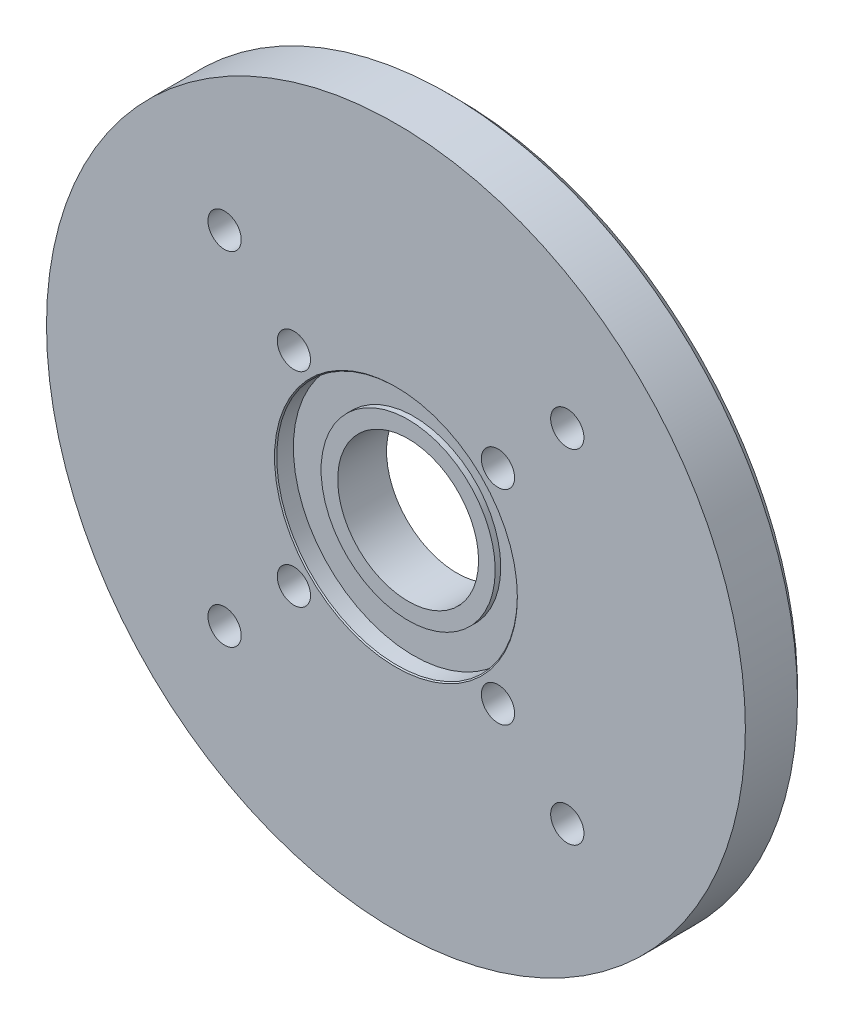
ISO-10303-21;
HEADER;
FILE_DESCRIPTION(('STEP AP214'),'2;1');
FILE_NAME('part.step','',(''),(''),'','','');
FILE_SCHEMA(('AUTOMOTIVE_DESIGN { 1 0 10303 214 1 1 1 1 }'));
ENDSEC;
DATA;
#1=APPLICATION_CONTEXT('core data for automotive mechanical design processes');
#2=APPLICATION_PROTOCOL_DEFINITION('international standard','automotive_design',2000,#1);
#3=PRODUCT_CONTEXT('',#1,'mechanical');
#4=PRODUCT('Part','Part','',(#3));
#5=PRODUCT_RELATED_PRODUCT_CATEGORY('part','',(#4));
#6=PRODUCT_DEFINITION_FORMATION('','',#4);
#7=PRODUCT_DEFINITION_CONTEXT('part definition',#1,'design');
#8=PRODUCT_DEFINITION('design','',#6,#7);
#9=PRODUCT_DEFINITION_SHAPE('','',#8);
#10=(LENGTH_UNIT() NAMED_UNIT(*) SI_UNIT(.MILLI.,.METRE.));
#11=(NAMED_UNIT(*) PLANE_ANGLE_UNIT() SI_UNIT($,.RADIAN.));
#12=(NAMED_UNIT(*) SI_UNIT($,.STERADIAN.) SOLID_ANGLE_UNIT());
#13=UNCERTAINTY_MEASURE_WITH_UNIT(LENGTH_MEASURE(1.E-05),#10,'distance_accuracy_value','');
#14=(GEOMETRIC_REPRESENTATION_CONTEXT(3) GLOBAL_UNCERTAINTY_ASSIGNED_CONTEXT((#13)) GLOBAL_UNIT_ASSIGNED_CONTEXT((#10,
#11,#12)) REPRESENTATION_CONTEXT('',''));
#15=CARTESIAN_POINT('',(0.,0.,0.));
#16=DIRECTION('',(0.,0.,1.));
#17=DIRECTION('',(1.,0.,0.));
#18=AXIS2_PLACEMENT_3D('',#15,#16,#17);
#19=CARTESIAN_POINT('',(-15.45,-15.45,5.5));
#20=DIRECTION('',(0.,0.,-1.));
#21=DIRECTION('',(-1.,0.,0.));
#22=AXIS2_PLACEMENT_3D('',#19,#20,#21);
#23=CYLINDRICAL_SURFACE('',#22,1.5);
#24=CARTESIAN_POINT('',(-15.45,-15.45,5.5));
#25=DIRECTION('',(0.,0.,-1.));
#26=DIRECTION('',(-1.,0.,0.));
#27=AXIS2_PLACEMENT_3D('',#24,#25,#26);
#28=CIRCLE('',#27,1.5);
#29=CARTESIAN_POINT('',(-13.95,-15.45,5.5));
#30=VERTEX_POINT('',#29);
#31=EDGE_CURVE('E193',#30,#30,#28,.T.);
#32=ORIENTED_EDGE('',*,*,#31,.F.);
#33=DIRECTION('',(0.,0.,-1.));
#34=VECTOR('',#33,1.);
#35=CARTESIAN_POINT('',(-13.95,-15.45,5.5));
#36=LINE('',#35,#34);
#37=CARTESIAN_POINT('',(-13.95,-15.45,0.));
#38=VERTEX_POINT('',#37);
#39=EDGE_CURVE('E10',#30,#38,#36,.T.);
#40=ORIENTED_EDGE('',*,*,#39,.T.);
#41=CARTESIAN_POINT('',(-15.45,-15.45,0.));
#42=DIRECTION('',(0.,0.,1.));
#43=DIRECTION('',(-1.,0.,0.));
#44=AXIS2_PLACEMENT_3D('',#41,#42,#43);
#45=CIRCLE('',#44,1.5);
#46=EDGE_CURVE('E146',#38,#38,#45,.T.);
#47=ORIENTED_EDGE('',*,*,#46,.F.);
#48=ORIENTED_EDGE('',*,*,#39,.F.);
#49=EDGE_LOOP('',(#32,#40,#47,#48));
#50=FACE_BOUND('',#49,.T.);
#51=ADVANCED_FACE('F18',(#50),#23,.F.);
#52=CARTESIAN_POINT('',(-9.2,9.2,5.5));
#53=DIRECTION('',(0.,0.,-1.));
#54=DIRECTION('',(-1.,0.,0.));
#55=AXIS2_PLACEMENT_3D('',#52,#53,#54);
#56=CYLINDRICAL_SURFACE('',#55,1.5);
#57=CARTESIAN_POINT('',(-9.2,9.2,5.5));
#58=DIRECTION('',(0.,0.,-1.));
#59=DIRECTION('',(-1.,0.,0.));
#60=AXIS2_PLACEMENT_3D('',#57,#58,#59);
#61=CIRCLE('',#60,1.5);
#62=CARTESIAN_POINT('',(-7.7,9.2,5.5));
#63=VERTEX_POINT('',#62);
#64=EDGE_CURVE('E197',#63,#63,#61,.T.);
#65=ORIENTED_EDGE('',*,*,#64,.F.);
#66=DIRECTION('',(0.,0.,-1.));
#67=VECTOR('',#66,1.);
#68=CARTESIAN_POINT('',(-7.7,9.2,5.5));
#69=LINE('',#68,#67);
#70=CARTESIAN_POINT('',(-7.7,9.2,0.));
#71=VERTEX_POINT('',#70);
#72=EDGE_CURVE('E29',#63,#71,#69,.T.);
#73=ORIENTED_EDGE('',*,*,#72,.T.);
#74=CARTESIAN_POINT('',(-9.2,9.2,0.));
#75=DIRECTION('',(0.,0.,1.));
#76=DIRECTION('',(-1.,0.,0.));
#77=AXIS2_PLACEMENT_3D('',#74,#75,#76);
#78=CIRCLE('',#77,1.5);
#79=EDGE_CURVE('E153',#71,#71,#78,.T.);
#80=ORIENTED_EDGE('',*,*,#79,.F.);
#81=ORIENTED_EDGE('',*,*,#72,.F.);
#82=EDGE_LOOP('',(#65,#73,#80,#81));
#83=FACE_BOUND('',#82,.T.);
#84=ADVANCED_FACE('F340',(#83),#56,.F.);
#85=CARTESIAN_POINT('',(-15.45,15.45,5.5));
#86=DIRECTION('',(0.,0.,-1.));
#87=DIRECTION('',(-1.,0.,0.));
#88=AXIS2_PLACEMENT_3D('',#85,#86,#87);
#89=CYLINDRICAL_SURFACE('',#88,1.5);
#90=CARTESIAN_POINT('',(-15.45,15.45,5.5));
#91=DIRECTION('',(0.,0.,-1.));
#92=DIRECTION('',(-1.,0.,0.));
#93=AXIS2_PLACEMENT_3D('',#90,#91,#92);
#94=CIRCLE('',#93,1.5);
#95=CARTESIAN_POINT('',(-13.95,15.45,5.5));
#96=VERTEX_POINT('',#95);
#97=EDGE_CURVE('E254',#96,#96,#94,.T.);
#98=ORIENTED_EDGE('',*,*,#97,.F.);
#99=DIRECTION('',(0.,0.,-1.));
#100=VECTOR('',#99,1.);
#101=CARTESIAN_POINT('',(-13.95,15.45,5.5));
#102=LINE('',#101,#100);
#103=CARTESIAN_POINT('',(-13.95,15.45,0.));
#104=VERTEX_POINT('',#103);
#105=EDGE_CURVE('E243',#96,#104,#102,.T.);
#106=ORIENTED_EDGE('',*,*,#105,.T.);
#107=CARTESIAN_POINT('',(-15.45,15.45,0.));
#108=DIRECTION('',(0.,0.,1.));
#109=DIRECTION('',(-1.,0.,0.));
#110=AXIS2_PLACEMENT_3D('',#107,#108,#109);
#111=CIRCLE('',#110,1.5);
#112=EDGE_CURVE('E176',#104,#104,#111,.T.);
#113=ORIENTED_EDGE('',*,*,#112,.F.);
#114=ORIENTED_EDGE('',*,*,#105,.F.);
#115=EDGE_LOOP('',(#98,#106,#113,#114));
#116=FACE_BOUND('',#115,.T.);
#117=ADVANCED_FACE('F345',(#116),#89,.F.);
#118=CARTESIAN_POINT('',(-9.2,-9.2,5.5));
#119=DIRECTION('',(0.,0.,-1.));
#120=DIRECTION('',(-1.,0.,0.));
#121=AXIS2_PLACEMENT_3D('',#118,#119,#120);
#122=CYLINDRICAL_SURFACE('',#121,1.5);
#123=CARTESIAN_POINT('',(-9.2,-9.2,5.5));
#124=DIRECTION('',(0.,0.,-1.));
#125=DIRECTION('',(-1.,0.,0.));
#126=AXIS2_PLACEMENT_3D('',#123,#124,#125);
#127=CIRCLE('',#126,1.5);
#128=CARTESIAN_POINT('',(-7.7,-9.2,5.5));
#129=VERTEX_POINT('',#128);
#130=EDGE_CURVE('E202',#129,#129,#127,.T.);
#131=ORIENTED_EDGE('',*,*,#130,.F.);
#132=DIRECTION('',(0.,0.,-1.));
#133=VECTOR('',#132,1.);
#134=CARTESIAN_POINT('',(-7.7,-9.2,5.5));
#135=LINE('',#134,#133);
#136=CARTESIAN_POINT('',(-7.7,-9.2,0.));
#137=VERTEX_POINT('',#136);
#138=EDGE_CURVE('E246',#129,#137,#135,.T.);
#139=ORIENTED_EDGE('',*,*,#138,.T.);
#140=CARTESIAN_POINT('',(-9.2,-9.2,0.));
#141=DIRECTION('',(0.,0.,1.));
#142=DIRECTION('',(-1.,0.,0.));
#143=AXIS2_PLACEMENT_3D('',#140,#141,#142);
#144=CIRCLE('',#143,1.5);
#145=EDGE_CURVE('E172',#137,#137,#144,.T.);
#146=ORIENTED_EDGE('',*,*,#145,.F.);
#147=ORIENTED_EDGE('',*,*,#138,.F.);
#148=EDGE_LOOP('',(#131,#139,#146,#147));
#149=FACE_BOUND('',#148,.T.);
#150=ADVANCED_FACE('F356',(#149),#122,.F.);
#151=CARTESIAN_POINT('',(15.45,-15.45,5.5));
#152=DIRECTION('',(0.,0.,-1.));
#153=DIRECTION('',(-1.,0.,0.));
#154=AXIS2_PLACEMENT_3D('',#151,#152,#153);
#155=CYLINDRICAL_SURFACE('',#154,1.5);
#156=CARTESIAN_POINT('',(15.45,-15.45,5.5));
#157=DIRECTION('',(0.,0.,-1.));
#158=DIRECTION('',(-1.,0.,0.));
#159=AXIS2_PLACEMENT_3D('',#156,#157,#158);
#160=CIRCLE('',#159,1.5);
#161=CARTESIAN_POINT('',(16.95,-15.45,5.5));
#162=VERTEX_POINT('',#161);
#163=EDGE_CURVE('E166',#162,#162,#160,.T.);
#164=ORIENTED_EDGE('',*,*,#163,.F.);
#165=DIRECTION('',(0.,0.,-1.));
#166=VECTOR('',#165,1.);
#167=CARTESIAN_POINT('',(16.95,-15.45,5.5));
#168=LINE('',#167,#166);
#169=CARTESIAN_POINT('',(16.95,-15.45,0.));
#170=VERTEX_POINT('',#169);
#171=EDGE_CURVE('E22',#162,#170,#168,.T.);
#172=ORIENTED_EDGE('',*,*,#171,.T.);
#173=CARTESIAN_POINT('',(15.45,-15.45,0.));
#174=DIRECTION('',(0.,0.,1.));
#175=DIRECTION('',(-1.,0.,0.));
#176=AXIS2_PLACEMENT_3D('',#173,#174,#175);
#177=CIRCLE('',#176,1.5);
#178=EDGE_CURVE('E167',#170,#170,#177,.T.);
#179=ORIENTED_EDGE('',*,*,#178,.F.);
#180=ORIENTED_EDGE('',*,*,#171,.F.);
#181=EDGE_LOOP('',(#164,#172,#179,#180));
#182=FACE_BOUND('',#181,.T.);
#183=ADVANCED_FACE('F352',(#182),#155,.F.);
#184=CARTESIAN_POINT('',(9.2,9.2,5.5));
#185=DIRECTION('',(0.,0.,-1.));
#186=DIRECTION('',(-1.,0.,0.));
#187=AXIS2_PLACEMENT_3D('',#184,#185,#186);
#188=CYLINDRICAL_SURFACE('',#187,1.5);
#189=CARTESIAN_POINT('',(9.2,9.2,5.5));
#190=DIRECTION('',(0.,0.,-1.));
#191=DIRECTION('',(-1.,0.,0.));
#192=AXIS2_PLACEMENT_3D('',#189,#190,#191);
#193=CIRCLE('',#192,1.5);
#194=CARTESIAN_POINT('',(10.7,9.2,5.5));
#195=VERTEX_POINT('',#194);
#196=EDGE_CURVE('E162',#195,#195,#193,.T.);
#197=ORIENTED_EDGE('',*,*,#196,.F.);
#198=DIRECTION('',(0.,0.,-1.));
#199=VECTOR('',#198,1.);
#200=CARTESIAN_POINT('',(10.7,9.2,5.5));
#201=LINE('',#200,#199);
#202=CARTESIAN_POINT('',(10.7,9.2,0.));
#203=VERTEX_POINT('',#202);
#204=EDGE_CURVE('E210',#195,#203,#201,.T.);
#205=ORIENTED_EDGE('',*,*,#204,.T.);
#206=CARTESIAN_POINT('',(9.2,9.2,0.));
#207=DIRECTION('',(0.,0.,1.));
#208=DIRECTION('',(-1.,0.,0.));
#209=AXIS2_PLACEMENT_3D('',#206,#207,#208);
#210=CIRCLE('',#209,1.5);
#211=EDGE_CURVE('E171',#203,#203,#210,.T.);
#212=ORIENTED_EDGE('',*,*,#211,.F.);
#213=ORIENTED_EDGE('',*,*,#204,.F.);
#214=EDGE_LOOP('',(#197,#205,#212,#213));
#215=FACE_BOUND('',#214,.T.);
#216=ADVANCED_FACE('F355',(#215),#188,.F.);
#217=CARTESIAN_POINT('',(15.45,15.45,5.5));
#218=DIRECTION('',(0.,0.,-1.));
#219=DIRECTION('',(-1.,0.,0.));
#220=AXIS2_PLACEMENT_3D('',#217,#218,#219);
#221=CYLINDRICAL_SURFACE('',#220,1.5);
#222=CARTESIAN_POINT('',(15.45,15.45,5.5));
#223=DIRECTION('',(0.,0.,-1.));
#224=DIRECTION('',(-1.,0.,0.));
#225=AXIS2_PLACEMENT_3D('',#222,#223,#224);
#226=CIRCLE('',#225,1.5);
#227=CARTESIAN_POINT('',(16.95,15.45,5.5));
#228=VERTEX_POINT('',#227);
#229=EDGE_CURVE('E165',#228,#228,#226,.T.);
#230=ORIENTED_EDGE('',*,*,#229,.F.);
#231=DIRECTION('',(0.,0.,-1.));
#232=VECTOR('',#231,1.);
#233=CARTESIAN_POINT('',(16.95,15.45,5.5));
#234=LINE('',#233,#232);
#235=CARTESIAN_POINT('',(16.95,15.45,0.));
#236=VERTEX_POINT('',#235);
#237=EDGE_CURVE('E213',#228,#236,#234,.T.);
#238=ORIENTED_EDGE('',*,*,#237,.T.);
#239=CARTESIAN_POINT('',(15.45,15.45,0.));
#240=DIRECTION('',(0.,0.,1.));
#241=DIRECTION('',(-1.,0.,0.));
#242=AXIS2_PLACEMENT_3D('',#239,#240,#241);
#243=CIRCLE('',#242,1.5);
#244=EDGE_CURVE('E214',#236,#236,#243,.T.);
#245=ORIENTED_EDGE('',*,*,#244,.F.);
#246=ORIENTED_EDGE('',*,*,#237,.F.);
#247=EDGE_LOOP('',(#230,#238,#245,#246));
#248=FACE_BOUND('',#247,.T.);
#249=ADVANCED_FACE('F349',(#248),#221,.F.);
#250=CARTESIAN_POINT('',(9.2,-9.2,5.5));
#251=DIRECTION('',(0.,0.,-1.));
#252=DIRECTION('',(-1.,0.,0.));
#253=AXIS2_PLACEMENT_3D('',#250,#251,#252);
#254=CYLINDRICAL_SURFACE('',#253,1.5);
#255=CARTESIAN_POINT('',(9.2,-9.2,5.5));
#256=DIRECTION('',(0.,0.,-1.));
#257=DIRECTION('',(-1.,0.,0.));
#258=AXIS2_PLACEMENT_3D('',#255,#256,#257);
#259=CIRCLE('',#258,1.5);
#260=CARTESIAN_POINT('',(10.7,-9.2,5.5));
#261=VERTEX_POINT('',#260);
#262=EDGE_CURVE('E206',#261,#261,#259,.T.);
#263=ORIENTED_EDGE('',*,*,#262,.F.);
#264=DIRECTION('',(0.,0.,-1.));
#265=VECTOR('',#264,1.);
#266=CARTESIAN_POINT('',(10.7,-9.2,5.5));
#267=LINE('',#266,#265);
#268=CARTESIAN_POINT('',(10.7,-9.2,0.));
#269=VERTEX_POINT('',#268);
#270=EDGE_CURVE('E218',#261,#269,#267,.T.);
#271=ORIENTED_EDGE('',*,*,#270,.T.);
#272=CARTESIAN_POINT('',(9.2,-9.2,0.));
#273=DIRECTION('',(0.,0.,1.));
#274=DIRECTION('',(-1.,0.,0.));
#275=AXIS2_PLACEMENT_3D('',#272,#273,#274);
#276=CIRCLE('',#275,1.5);
#277=EDGE_CURVE('E160',#269,#269,#276,.T.);
#278=ORIENTED_EDGE('',*,*,#277,.F.);
#279=ORIENTED_EDGE('',*,*,#270,.F.);
#280=EDGE_LOOP('',(#263,#271,#278,#279));
#281=FACE_BOUND('',#280,.T.);
#282=ADVANCED_FACE('F371',(#281),#254,.F.);
#283=CARTESIAN_POINT('',(0.,0.,5.5));
#284=DIRECTION('',(0.,0.,-1.));
#285=DIRECTION('',(-1.,0.,0.));
#286=AXIS2_PLACEMENT_3D('',#283,#284,#285);
#287=CYLINDRICAL_SURFACE('',#286,6.35);
#288=CARTESIAN_POINT('',(0.,0.,4.4));
#289=DIRECTION('',(0.,0.,-1.));
#290=DIRECTION('',(-1.,0.,0.));
#291=AXIS2_PLACEMENT_3D('',#288,#289,#290);
#292=CIRCLE('',#291,6.35);
#293=CARTESIAN_POINT('',(6.35,0.,4.4));
#294=VERTEX_POINT('',#293);
#295=EDGE_CURVE('E177',#294,#294,#292,.T.);
#296=ORIENTED_EDGE('',*,*,#295,.F.);
#297=DIRECTION('',(0.,0.,-1.));
#298=VECTOR('',#297,1.);
#299=CARTESIAN_POINT('',(6.35,0.,5.5));
#300=LINE('',#299,#298);
#301=CARTESIAN_POINT('',(6.35,0.,0.));
#302=VERTEX_POINT('',#301);
#303=EDGE_CURVE('E221',#294,#302,#300,.T.);
#304=ORIENTED_EDGE('',*,*,#303,.T.);
#305=CARTESIAN_POINT('',(0.,0.,0.));
#306=DIRECTION('',(0.,0.,1.));
#307=DIRECTION('',(-1.,0.,0.));
#308=AXIS2_PLACEMENT_3D('',#305,#306,#307);
#309=CIRCLE('',#308,6.35);
#310=EDGE_CURVE('E198',#302,#302,#309,.T.);
#311=ORIENTED_EDGE('',*,*,#310,.F.);
#312=ORIENTED_EDGE('',*,*,#303,.F.);
#313=EDGE_LOOP('',(#296,#304,#311,#312));
#314=FACE_BOUND('',#313,.T.);
#315=ADVANCED_FACE('F296',(#314),#287,.F.);
#316=CARTESIAN_POINT('',(0.,0.,3.9));
#317=DIRECTION('',(0.,0.,1.));
#318=DIRECTION('',(1.,0.,0.));
#319=AXIS2_PLACEMENT_3D('',#316,#317,#318);
#320=PLANE('',#319);
#321=CARTESIAN_POINT('',(0.,0.,3.9));
#322=DIRECTION('',(0.,0.,-1.));
#323=DIRECTION('',(-1.,0.,0.));
#324=AXIS2_PLACEMENT_3D('',#321,#322,#323);
#325=CIRCLE('',#324,7.85);
#326=CARTESIAN_POINT('',(7.85,0.,3.9));
#327=VERTEX_POINT('',#326);
#328=EDGE_CURVE('E182',#327,#327,#325,.T.);
#329=ORIENTED_EDGE('',*,*,#328,.T.);
#330=EDGE_LOOP('',(#329));
#331=FACE_BOUND('',#330,.T.);
#332=CARTESIAN_POINT('',(0.,0.,3.9));
#333=DIRECTION('',(0.,0.,-1.));
#334=DIRECTION('',(-1.,0.,0.));
#335=AXIS2_PLACEMENT_3D('',#332,#333,#334);
#336=CIRCLE('',#335,10.85);
#337=CARTESIAN_POINT('',(10.85,0.,3.9));
#338=VERTEX_POINT('',#337);
#339=EDGE_CURVE('E43',#338,#338,#336,.T.);
#340=ORIENTED_EDGE('',*,*,#339,.F.);
#341=EDGE_LOOP('',(#340));
#342=FACE_BOUND('',#341,.T.);
#343=ADVANCED_FACE('F292',(#331,#342),#320,.T.);
#344=CARTESIAN_POINT('',(0.,0.,5.5));
#345=DIRECTION('',(0.,0.,-1.));
#346=DIRECTION('',(-1.,0.,0.));
#347=AXIS2_PLACEMENT_3D('',#344,#345,#346);
#348=CYLINDRICAL_SURFACE('',#347,10.85);
#349=CARTESIAN_POINT('',(0.,0.,5.4));
#350=DIRECTION('',(0.,0.,-1.));
#351=DIRECTION('',(-1.,0.,0.));
#352=AXIS2_PLACEMENT_3D('',#349,#350,#351);
#353=CIRCLE('',#352,10.85);
#354=CARTESIAN_POINT('',(10.85,0.,5.4));
#355=VERTEX_POINT('',#354);
#356=EDGE_CURVE('E186',#355,#355,#353,.T.);
#357=ORIENTED_EDGE('',*,*,#356,.F.);
#358=DIRECTION('',(0.,0.,-1.));
#359=VECTOR('',#358,1.);
#360=CARTESIAN_POINT('',(10.85,0.,5.5));
#361=LINE('',#360,#359);
#362=EDGE_CURVE('E183',#355,#338,#361,.T.);
#363=ORIENTED_EDGE('',*,*,#362,.T.);
#364=ORIENTED_EDGE('',*,*,#339,.T.);
#365=ORIENTED_EDGE('',*,*,#362,.F.);
#366=EDGE_LOOP('',(#357,#363,#364,#365));
#367=FACE_BOUND('',#366,.T.);
#368=ADVANCED_FACE('F295',(#367),#348,.F.);
#369=CARTESIAN_POINT('',(0.,0.,5.45));
#370=DIRECTION('',(0.,0.,1.));
#371=DIRECTION('',(-1.,0.,0.));
#372=AXIS2_PLACEMENT_3D('',#369,#370,#371);
#373=CONICAL_SURFACE('',#372,10.9,0.785398163397448);
#374=CARTESIAN_POINT('',(0.,0.,5.5));
#375=DIRECTION('',(0.,0.,1.));
#376=DIRECTION('',(-1.,0.,0.));
#377=AXIS2_PLACEMENT_3D('',#374,#375,#376);
#378=CIRCLE('',#377,10.95);
#379=CARTESIAN_POINT('',(10.95,0.,5.5));
#380=VERTEX_POINT('',#379);
#381=EDGE_CURVE('E222',#380,#380,#378,.T.);
#382=ORIENTED_EDGE('',*,*,#381,.T.);
#383=DIRECTION('',(-0.707106781186548,0.,-0.707106781186548));
#384=VECTOR('',#383,1.);
#385=CARTESIAN_POINT('',(10.9,0.,5.45));
#386=LINE('',#385,#384);
#387=EDGE_CURVE('E181',#380,#355,#386,.T.);
#388=ORIENTED_EDGE('',*,*,#387,.T.);
#389=ORIENTED_EDGE('',*,*,#356,.T.);
#390=ORIENTED_EDGE('',*,*,#387,.F.);
#391=EDGE_LOOP('',(#382,#388,#389,#390));
#392=FACE_BOUND('',#391,.T.);
#393=ADVANCED_FACE('F300',(#392),#373,.F.);
#394=CARTESIAN_POINT('',(0.,0.,4.4));
#395=DIRECTION('',(0.,0.,1.));
#396=DIRECTION('',(1.,0.,0.));
#397=AXIS2_PLACEMENT_3D('',#394,#395,#396);
#398=PLANE('',#397);
#399=ORIENTED_EDGE('',*,*,#295,.T.);
#400=EDGE_LOOP('',(#399));
#401=FACE_BOUND('',#400,.T.);
#402=CARTESIAN_POINT('',(0.,0.,4.4));
#403=DIRECTION('',(0.,0.,1.));
#404=DIRECTION('',(-1.,0.,0.));
#405=AXIS2_PLACEMENT_3D('',#402,#403,#404);
#406=CIRCLE('',#405,7.85);
#407=CARTESIAN_POINT('',(7.85,0.,4.4));
#408=VERTEX_POINT('',#407);
#409=EDGE_CURVE('E225',#408,#408,#406,.T.);
#410=ORIENTED_EDGE('',*,*,#409,.T.);
#411=EDGE_LOOP('',(#410));
#412=FACE_BOUND('',#411,.T.);
#413=ADVANCED_FACE('F287',(#401,#412),#398,.T.);
#414=CARTESIAN_POINT('',(0.,0.,3.9));
#415=DIRECTION('',(0.,0.,1.));
#416=DIRECTION('',(-1.,0.,0.));
#417=AXIS2_PLACEMENT_3D('',#414,#415,#416);
#418=CYLINDRICAL_SURFACE('',#417,7.85);
#419=ORIENTED_EDGE('',*,*,#409,.F.);
#420=DIRECTION('',(0.,0.,-1.));
#421=VECTOR('',#420,1.);
#422=CARTESIAN_POINT('',(7.85,0.,3.9));
#423=LINE('',#422,#421);
#424=EDGE_CURVE('E189',#408,#327,#423,.T.);
#425=ORIENTED_EDGE('',*,*,#424,.T.);
#426=ORIENTED_EDGE('',*,*,#328,.F.);
#427=ORIENTED_EDGE('',*,*,#424,.F.);
#428=EDGE_LOOP('',(#419,#425,#426,#427));
#429=FACE_BOUND('',#428,.T.);
#430=ADVANCED_FACE('F289',(#429),#418,.T.);
#431=CARTESIAN_POINT('',(0.,0.,5.5));
#432=DIRECTION('',(0.,0.,1.));
#433=DIRECTION('',(1.,0.,0.));
#434=AXIS2_PLACEMENT_3D('',#431,#432,#433);
#435=PLANE('',#434);
#436=ORIENTED_EDGE('',*,*,#381,.F.);
#437=EDGE_LOOP('',(#436));
#438=FACE_BOUND('',#437,.T.);
#439=ORIENTED_EDGE('',*,*,#262,.T.);
#440=EDGE_LOOP('',(#439));
#441=FACE_BOUND('',#440,.T.);
#442=ORIENTED_EDGE('',*,*,#229,.T.);
#443=EDGE_LOOP('',(#442));
#444=FACE_BOUND('',#443,.T.);
#445=ORIENTED_EDGE('',*,*,#196,.T.);
#446=EDGE_LOOP('',(#445));
#447=FACE_BOUND('',#446,.T.);
#448=ORIENTED_EDGE('',*,*,#163,.T.);
#449=EDGE_LOOP('',(#448));
#450=FACE_BOUND('',#449,.T.);
#451=ORIENTED_EDGE('',*,*,#130,.T.);
#452=EDGE_LOOP('',(#451));
#453=FACE_BOUND('',#452,.T.);
#454=ORIENTED_EDGE('',*,*,#97,.T.);
#455=EDGE_LOOP('',(#454));
#456=FACE_BOUND('',#455,.T.);
#457=ORIENTED_EDGE('',*,*,#64,.T.);
#458=EDGE_LOOP('',(#457));
#459=FACE_BOUND('',#458,.T.);
#460=ORIENTED_EDGE('',*,*,#31,.T.);
#461=EDGE_LOOP('',(#460));
#462=FACE_BOUND('',#461,.T.);
#463=CARTESIAN_POINT('',(0.,0.,5.5));
#464=DIRECTION('',(0.,0.,-1.));
#465=DIRECTION('',(1.,0.,0.));
#466=AXIS2_PLACEMENT_3D('',#463,#464,#465);
#467=CIRCLE('',#466,31.51);
#468=CARTESIAN_POINT('',(-31.51,0.,5.5));
#469=VERTEX_POINT('',#468);
#470=EDGE_CURVE('E141',#469,#469,#467,.T.);
#471=ORIENTED_EDGE('',*,*,#470,.F.);
#472=EDGE_LOOP('',(#471));
#473=FACE_BOUND('',#472,.T.);
#474=ADVANCED_FACE('F303',(#438,#441,#444,#447,#450,#453,#456,#459,#462,#473),#435,.T.);
#475=CARTESIAN_POINT('',(0.,0.,0.));
#476=DIRECTION('',(0.,0.,1.));
#477=DIRECTION('',(1.,0.,0.));
#478=AXIS2_PLACEMENT_3D('',#475,#476,#477);
#479=PLANE('',#478);
#480=ORIENTED_EDGE('',*,*,#310,.T.);
#481=EDGE_LOOP('',(#480));
#482=FACE_BOUND('',#481,.T.);
#483=ORIENTED_EDGE('',*,*,#277,.T.);
#484=EDGE_LOOP('',(#483));
#485=FACE_BOUND('',#484,.T.);
#486=ORIENTED_EDGE('',*,*,#244,.T.);
#487=EDGE_LOOP('',(#486));
#488=FACE_BOUND('',#487,.T.);
#489=ORIENTED_EDGE('',*,*,#211,.T.);
#490=EDGE_LOOP('',(#489));
#491=FACE_BOUND('',#490,.T.);
#492=ORIENTED_EDGE('',*,*,#178,.T.);
#493=EDGE_LOOP('',(#492));
#494=FACE_BOUND('',#493,.T.);
#495=ORIENTED_EDGE('',*,*,#145,.T.);
#496=EDGE_LOOP('',(#495));
#497=FACE_BOUND('',#496,.T.);
#498=ORIENTED_EDGE('',*,*,#112,.T.);
#499=EDGE_LOOP('',(#498));
#500=FACE_BOUND('',#499,.T.);
#501=ORIENTED_EDGE('',*,*,#79,.T.);
#502=EDGE_LOOP('',(#501));
#503=FACE_BOUND('',#502,.T.);
#504=ORIENTED_EDGE('',*,*,#46,.T.);
#505=EDGE_LOOP('',(#504));
#506=FACE_BOUND('',#505,.T.);
#507=CARTESIAN_POINT('',(0.,0.,0.));
#508=DIRECTION('',(0.,0.,1.));
#509=DIRECTION('',(1.,0.,0.));
#510=AXIS2_PLACEMENT_3D('',#507,#508,#509);
#511=CIRCLE('',#510,30.71);
#512=CARTESIAN_POINT('',(-30.71,0.,0.));
#513=VERTEX_POINT('',#512);
#514=EDGE_CURVE('E156',#513,#513,#511,.T.);
#515=ORIENTED_EDGE('',*,*,#514,.F.);
#516=EDGE_LOOP('',(#515));
#517=FACE_BOUND('',#516,.T.);
#518=ADVANCED_FACE('F306',(#482,#485,#488,#491,#494,#497,#500,#503,#506,#517),#479,.F.);
#519=CARTESIAN_POINT('',(0.,0.,0.));
#520=DIRECTION('',(0.,0.,1.));
#521=DIRECTION('',(1.,0.,0.));
#522=AXIS2_PLACEMENT_3D('',#519,#520,#521);
#523=CYLINDRICAL_SURFACE('',#522,31.51);
#524=ORIENTED_EDGE('',*,*,#470,.T.);
#525=DIRECTION('',(0.,0.,-1.));
#526=VECTOR('',#525,1.);
#527=CARTESIAN_POINT('',(-31.51,0.,0.));
#528=LINE('',#527,#526);
#529=CARTESIAN_POINT('',(-31.51,0.,0.8));
#530=VERTEX_POINT('',#529);
#531=EDGE_CURVE('E138',#469,#530,#528,.T.);
#532=ORIENTED_EDGE('',*,*,#531,.T.);
#533=CARTESIAN_POINT('',(0.,0.,0.8));
#534=DIRECTION('',(0.,0.,-1.));
#535=DIRECTION('',(1.,0.,0.));
#536=AXIS2_PLACEMENT_3D('',#533,#534,#535);
#537=CIRCLE('',#536,31.51);
#538=EDGE_CURVE('E143',#530,#530,#537,.T.);
#539=ORIENTED_EDGE('',*,*,#538,.F.);
#540=ORIENTED_EDGE('',*,*,#531,.F.);
#541=EDGE_LOOP('',(#524,#532,#539,#540));
#542=FACE_BOUND('',#541,.T.);
#543=ADVANCED_FACE('F139',(#542),#523,.T.);
#544=CARTESIAN_POINT('',(0.,0.,0.4));
#545=DIRECTION('',(0.,0.,1.));
#546=DIRECTION('',(1.,0.,0.));
#547=AXIS2_PLACEMENT_3D('',#544,#545,#546);
#548=CONICAL_SURFACE('',#547,31.11,0.785398163397449);
#549=ORIENTED_EDGE('',*,*,#538,.T.);
#550=DIRECTION('',(0.707106781186548,0.,-0.707106781186547));
#551=VECTOR('',#550,1.);
#552=CARTESIAN_POINT('',(-31.11,0.,0.4));
#553=LINE('',#552,#551);
#554=EDGE_CURVE('E239',#530,#513,#553,.T.);
#555=ORIENTED_EDGE('',*,*,#554,.T.);
#556=ORIENTED_EDGE('',*,*,#514,.T.);
#557=ORIENTED_EDGE('',*,*,#554,.F.);
#558=EDGE_LOOP('',(#549,#555,#556,#557));
#559=FACE_BOUND('',#558,.T.);
#560=ADVANCED_FACE('F20',(#559),#548,.T.);
#561=CLOSED_SHELL('',(#51,#84,#117,#150,#183,#216,#249,#282,#315,#343,#368,#393,#413,#430,#474,
#518,#543,#560));
#562=MANIFOLD_SOLID_BREP('B1',#561);
#563=ADVANCED_BREP_SHAPE_REPRESENTATION('',(#18,#562),#14);
#564=SHAPE_DEFINITION_REPRESENTATION(#9,#563);
ENDSEC;
END-ISO-10303-21;
